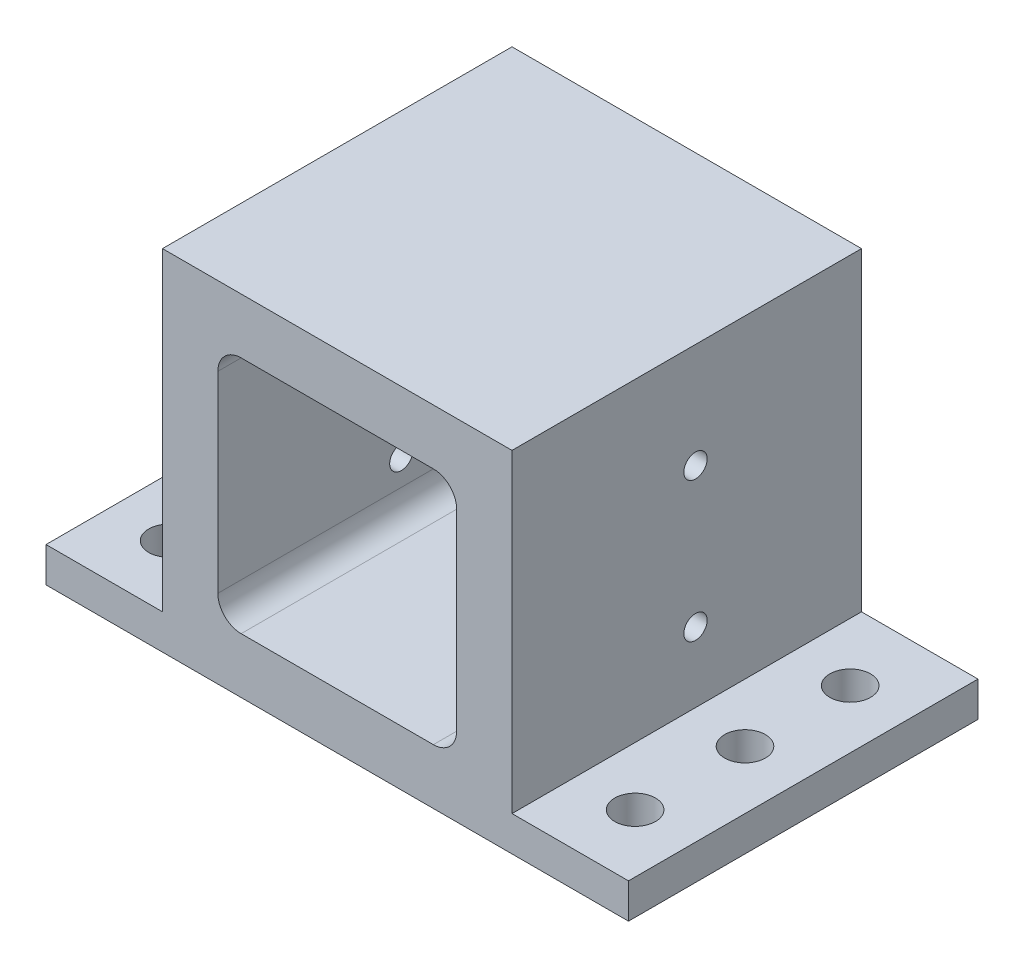
ISO-10303-21;
HEADER;
FILE_DESCRIPTION(('STEP AP214'),'2;1');
FILE_NAME('part.step','',(''),(''),'','','');
FILE_SCHEMA(('AUTOMOTIVE_DESIGN { 1 0 10303 214 1 1 1 1 }'));
ENDSEC;
DATA;
#1=APPLICATION_CONTEXT('core data for automotive mechanical design processes');
#2=APPLICATION_PROTOCOL_DEFINITION('international standard','automotive_design',2000,#1);
#3=PRODUCT_CONTEXT('',#1,'mechanical');
#4=PRODUCT('Part','Part','',(#3));
#5=PRODUCT_RELATED_PRODUCT_CATEGORY('part','',(#4));
#6=PRODUCT_DEFINITION_FORMATION('','',#4);
#7=PRODUCT_DEFINITION_CONTEXT('part definition',#1,'design');
#8=PRODUCT_DEFINITION('design','',#6,#7);
#9=PRODUCT_DEFINITION_SHAPE('','',#8);
#10=(LENGTH_UNIT() NAMED_UNIT(*) SI_UNIT(.MILLI.,.METRE.));
#11=(NAMED_UNIT(*) PLANE_ANGLE_UNIT() SI_UNIT($,.RADIAN.));
#12=(NAMED_UNIT(*) SI_UNIT($,.STERADIAN.) SOLID_ANGLE_UNIT());
#13=UNCERTAINTY_MEASURE_WITH_UNIT(LENGTH_MEASURE(1.E-05),#10,'distance_accuracy_value','');
#14=(GEOMETRIC_REPRESENTATION_CONTEXT(3) GLOBAL_UNCERTAINTY_ASSIGNED_CONTEXT((#13)) GLOBAL_UNIT_ASSIGNED_CONTEXT((#10,
#11,#12)) REPRESENTATION_CONTEXT('',''));
#15=CARTESIAN_POINT('',(0.,0.,0.));
#16=DIRECTION('',(0.,0.,1.));
#17=DIRECTION('',(1.,0.,0.));
#18=AXIS2_PLACEMENT_3D('',#15,#16,#17);
#19=CARTESIAN_POINT('',(0.,-54.,-60.));
#20=DIRECTION('',(1.,0.,0.));
#21=DIRECTION('',(0.,1.,0.));
#22=AXIS2_PLACEMENT_3D('',#19,#20,#21);
#23=PLANE('',#22);
#24=CARTESIAN_POINT('',(0.,-18.,-31.5004037887663));
#25=DIRECTION('',(1.,0.,0.));
#26=DIRECTION('',(0.,1.,0.));
#27=AXIS2_PLACEMENT_3D('',#24,#25,#26);
#28=CIRCLE('',#27,2.);
#29=CARTESIAN_POINT('',(0.,-16.,-31.5004037887663));
#30=VERTEX_POINT('',#29);
#31=EDGE_CURVE('E293',#30,#30,#28,.T.);
#32=ORIENTED_EDGE('',*,*,#31,.F.);
#33=EDGE_LOOP('',(#32));
#34=FACE_BOUND('',#33,.T.);
#35=CARTESIAN_POINT('',(0.,-42.,-31.5004037887663));
#36=DIRECTION('',(1.,0.,0.));
#37=DIRECTION('',(0.,1.,0.));
#38=AXIS2_PLACEMENT_3D('',#35,#36,#37);
#39=CIRCLE('',#38,2.);
#40=CARTESIAN_POINT('',(0.,-40.,-31.5004037887663));
#41=VERTEX_POINT('',#40);
#42=EDGE_CURVE('E274',#41,#41,#39,.T.);
#43=ORIENTED_EDGE('',*,*,#42,.F.);
#44=EDGE_LOOP('',(#43));
#45=FACE_BOUND('',#44,.T.);
#46=DIRECTION('',(0.,1.,0.));
#47=VECTOR('',#46,1.);
#48=CARTESIAN_POINT('',(0.,-54.,0.));
#49=LINE('',#48,#47);
#50=CARTESIAN_POINT('',(0.,-54.,0.));
#51=VERTEX_POINT('',#50);
#52=CARTESIAN_POINT('',(0.,0.,0.));
#53=VERTEX_POINT('',#52);
#54=EDGE_CURVE('E195',#51,#53,#49,.T.);
#55=ORIENTED_EDGE('',*,*,#54,.F.);
#56=DIRECTION('',(0.,0.,1.));
#57=VECTOR('',#56,1.);
#58=CARTESIAN_POINT('',(0.,-54.,-60.));
#59=LINE('',#58,#57);
#60=CARTESIAN_POINT('',(0.,-54.,-60.));
#61=VERTEX_POINT('',#60);
#62=EDGE_CURVE('E171',#61,#51,#59,.T.);
#63=ORIENTED_EDGE('',*,*,#62,.F.);
#64=DIRECTION('',(0.,1.,0.));
#65=VECTOR('',#64,1.);
#66=CARTESIAN_POINT('',(0.,-54.,-60.));
#67=LINE('',#66,#65);
#68=CARTESIAN_POINT('',(0.,0.,-60.));
#69=VERTEX_POINT('',#68);
#70=EDGE_CURVE('E165',#61,#69,#67,.T.);
#71=ORIENTED_EDGE('',*,*,#70,.T.);
#72=DIRECTION('',(0.,0.,1.));
#73=VECTOR('',#72,1.);
#74=CARTESIAN_POINT('',(0.,0.,-60.));
#75=LINE('',#74,#73);
#76=EDGE_CURVE('E147',#69,#53,#75,.T.);
#77=ORIENTED_EDGE('',*,*,#76,.T.);
#78=EDGE_LOOP('',(#55,#63,#71,#77));
#79=FACE_BOUND('',#78,.T.);
#80=ADVANCED_FACE('F33',(#34,#45,#79),#23,.T.);
#81=CARTESIAN_POINT('',(20.,-54.,-60.));
#82=DIRECTION('',(0.,1.,0.));
#83=DIRECTION('',(-1.,0.,0.));
#84=AXIS2_PLACEMENT_3D('',#81,#82,#83);
#85=PLANE('',#84);
#86=CARTESIAN_POINT('',(10.,-54.,-11.1342769223496));
#87=DIRECTION('',(0.,1.,0.));
#88=DIRECTION('',(-1.,0.,0.));
#89=AXIS2_PLACEMENT_3D('',#86,#87,#88);
#90=CIRCLE('',#89,3.50000000000001);
#91=CARTESIAN_POINT('',(6.50000000000001,-54.,-11.1342769223496));
#92=VERTEX_POINT('',#91);
#93=EDGE_CURVE('E318',#92,#92,#90,.T.);
#94=ORIENTED_EDGE('',*,*,#93,.F.);
#95=EDGE_LOOP('',(#94));
#96=FACE_BOUND('',#95,.T.);
#97=CARTESIAN_POINT('',(10.,-54.,-30.));
#98=DIRECTION('',(0.,1.,0.));
#99=DIRECTION('',(-1.,0.,0.));
#100=AXIS2_PLACEMENT_3D('',#97,#98,#99);
#101=CIRCLE('',#100,3.50000000000001);
#102=CARTESIAN_POINT('',(6.50000000000001,-54.,-30.));
#103=VERTEX_POINT('',#102);
#104=EDGE_CURVE('E315',#103,#103,#101,.T.);
#105=ORIENTED_EDGE('',*,*,#104,.F.);
#106=EDGE_LOOP('',(#105));
#107=FACE_BOUND('',#106,.T.);
#108=CARTESIAN_POINT('',(10.,-54.,-48.0521069880478));
#109=DIRECTION('',(0.,1.,0.));
#110=DIRECTION('',(-1.,0.,0.));
#111=AXIS2_PLACEMENT_3D('',#108,#109,#110);
#112=CIRCLE('',#111,3.50000000000001);
#113=CARTESIAN_POINT('',(6.50000000000001,-54.,-48.0521069880478));
#114=VERTEX_POINT('',#113);
#115=EDGE_CURVE('E266',#114,#114,#112,.T.);
#116=ORIENTED_EDGE('',*,*,#115,.F.);
#117=EDGE_LOOP('',(#116));
#118=FACE_BOUND('',#117,.T.);
#119=DIRECTION('',(-1.,0.,0.));
#120=VECTOR('',#119,1.);
#121=CARTESIAN_POINT('',(20.,-54.,0.));
#122=LINE('',#121,#120);
#123=CARTESIAN_POINT('',(20.,-54.,0.));
#124=VERTEX_POINT('',#123);
#125=EDGE_CURVE('E172',#124,#51,#122,.T.);
#126=ORIENTED_EDGE('',*,*,#125,.F.);
#127=DIRECTION('',(0.,0.,1.));
#128=VECTOR('',#127,1.);
#129=CARTESIAN_POINT('',(20.,-54.,-60.));
#130=LINE('',#129,#128);
#131=CARTESIAN_POINT('',(20.,-54.,-60.));
#132=VERTEX_POINT('',#131);
#133=EDGE_CURVE('E215',#132,#124,#130,.T.);
#134=ORIENTED_EDGE('',*,*,#133,.F.);
#135=DIRECTION('',(-1.,0.,0.));
#136=VECTOR('',#135,1.);
#137=CARTESIAN_POINT('',(20.,-54.,-60.));
#138=LINE('',#137,#136);
#139=EDGE_CURVE('E158',#132,#61,#138,.T.);
#140=ORIENTED_EDGE('',*,*,#139,.T.);
#141=ORIENTED_EDGE('',*,*,#62,.T.);
#142=EDGE_LOOP('',(#126,#134,#140,#141));
#143=FACE_BOUND('',#142,.T.);
#144=ADVANCED_FACE('F378',(#96,#107,#118,#143),#85,.T.);
#145=CARTESIAN_POINT('',(20.,-60.,-60.));
#146=DIRECTION('',(1.,0.,0.));
#147=DIRECTION('',(0.,0.,-1.));
#148=AXIS2_PLACEMENT_3D('',#145,#146,#147);
#149=PLANE('',#148);
#150=DIRECTION('',(0.,1.,0.));
#151=VECTOR('',#150,1.);
#152=CARTESIAN_POINT('',(20.,-60.,0.));
#153=LINE('',#152,#151);
#154=CARTESIAN_POINT('',(20.,-60.,0.));
#155=VERTEX_POINT('',#154);
#156=EDGE_CURVE('E175',#155,#124,#153,.T.);
#157=ORIENTED_EDGE('',*,*,#156,.F.);
#158=DIRECTION('',(0.,0.,1.));
#159=VECTOR('',#158,1.);
#160=CARTESIAN_POINT('',(20.,-60.,-60.));
#161=LINE('',#160,#159);
#162=CARTESIAN_POINT('',(20.,-60.,-60.));
#163=VERTEX_POINT('',#162);
#164=EDGE_CURVE('E217',#163,#155,#161,.T.);
#165=ORIENTED_EDGE('',*,*,#164,.F.);
#166=DIRECTION('',(0.,1.,0.));
#167=VECTOR('',#166,1.);
#168=CARTESIAN_POINT('',(20.,-60.,-60.));
#169=LINE('',#168,#167);
#170=EDGE_CURVE('E191',#163,#132,#169,.T.);
#171=ORIENTED_EDGE('',*,*,#170,.T.);
#172=ORIENTED_EDGE('',*,*,#133,.T.);
#173=EDGE_LOOP('',(#157,#165,#171,#172));
#174=FACE_BOUND('',#173,.T.);
#175=ADVANCED_FACE('F412',(#174),#149,.T.);
#176=CARTESIAN_POINT('',(-80.,-60.,-60.));
#177=DIRECTION('',(0.,-1.,0.));
#178=DIRECTION('',(1.,0.,0.));
#179=AXIS2_PLACEMENT_3D('',#176,#177,#178);
#180=PLANE('',#179);
#181=CARTESIAN_POINT('',(10.,-60.,-11.1342769223496));
#182=DIRECTION('',(0.,-1.,0.));
#183=DIRECTION('',(-1.,0.,0.));
#184=AXIS2_PLACEMENT_3D('',#181,#182,#183);
#185=CIRCLE('',#184,3.50000000000001);
#186=CARTESIAN_POINT('',(6.50000000000001,-60.,-11.1342769223496));
#187=VERTEX_POINT('',#186);
#188=EDGE_CURVE('E296',#187,#187,#185,.T.);
#189=ORIENTED_EDGE('',*,*,#188,.F.);
#190=EDGE_LOOP('',(#189));
#191=FACE_BOUND('',#190,.T.);
#192=CARTESIAN_POINT('',(10.,-60.,-30.));
#193=DIRECTION('',(0.,-1.,0.));
#194=DIRECTION('',(-1.,0.,0.));
#195=AXIS2_PLACEMENT_3D('',#192,#193,#194);
#196=CIRCLE('',#195,3.50000000000001);
#197=CARTESIAN_POINT('',(6.50000000000001,-60.,-30.));
#198=VERTEX_POINT('',#197);
#199=EDGE_CURVE('E306',#198,#198,#196,.T.);
#200=ORIENTED_EDGE('',*,*,#199,.F.);
#201=EDGE_LOOP('',(#200));
#202=FACE_BOUND('',#201,.T.);
#203=CARTESIAN_POINT('',(10.,-60.,-48.0521069880478));
#204=DIRECTION('',(0.,-1.,0.));
#205=DIRECTION('',(-1.,0.,0.));
#206=AXIS2_PLACEMENT_3D('',#203,#204,#205);
#207=CIRCLE('',#206,3.50000000000001);
#208=CARTESIAN_POINT('',(6.50000000000001,-60.,-48.0521069880478));
#209=VERTEX_POINT('',#208);
#210=EDGE_CURVE('E303',#209,#209,#207,.T.);
#211=ORIENTED_EDGE('',*,*,#210,.F.);
#212=EDGE_LOOP('',(#211));
#213=FACE_BOUND('',#212,.T.);
#214=CARTESIAN_POINT('',(-70.,-60.,-48.0521069880478));
#215=DIRECTION('',(0.,-1.,0.));
#216=DIRECTION('',(1.,0.,0.));
#217=AXIS2_PLACEMENT_3D('',#214,#215,#216);
#218=CIRCLE('',#217,3.50000000000001);
#219=CARTESIAN_POINT('',(-66.5,-60.,-48.0521069880478));
#220=VERTEX_POINT('',#219);
#221=EDGE_CURVE('E300',#220,#220,#218,.T.);
#222=ORIENTED_EDGE('',*,*,#221,.F.);
#223=EDGE_LOOP('',(#222));
#224=FACE_BOUND('',#223,.T.);
#225=CARTESIAN_POINT('',(-70.,-60.,-30.));
#226=DIRECTION('',(0.,-1.,0.));
#227=DIRECTION('',(1.,0.,0.));
#228=AXIS2_PLACEMENT_3D('',#225,#226,#227);
#229=CIRCLE('',#228,3.50000000000001);
#230=CARTESIAN_POINT('',(-66.5,-60.,-30.));
#231=VERTEX_POINT('',#230);
#232=EDGE_CURVE('E297',#231,#231,#229,.T.);
#233=ORIENTED_EDGE('',*,*,#232,.F.);
#234=EDGE_LOOP('',(#233));
#235=FACE_BOUND('',#234,.T.);
#236=CARTESIAN_POINT('',(-70.,-60.,-11.1342769223496));
#237=DIRECTION('',(0.,-1.,0.));
#238=DIRECTION('',(1.,0.,0.));
#239=AXIS2_PLACEMENT_3D('',#236,#237,#238);
#240=CIRCLE('',#239,3.50000000000001);
#241=CARTESIAN_POINT('',(-66.5,-60.,-11.1342769223496));
#242=VERTEX_POINT('',#241);
#243=EDGE_CURVE('E261',#242,#242,#240,.T.);
#244=ORIENTED_EDGE('',*,*,#243,.F.);
#245=EDGE_LOOP('',(#244));
#246=FACE_BOUND('',#245,.T.);
#247=DIRECTION('',(1.,0.,0.));
#248=VECTOR('',#247,1.);
#249=CARTESIAN_POINT('',(-80.,-60.,0.));
#250=LINE('',#249,#248);
#251=CARTESIAN_POINT('',(-80.,-60.,0.));
#252=VERTEX_POINT('',#251);
#253=EDGE_CURVE('E208',#252,#155,#250,.T.);
#254=ORIENTED_EDGE('',*,*,#253,.F.);
#255=DIRECTION('',(0.,0.,1.));
#256=VECTOR('',#255,1.);
#257=CARTESIAN_POINT('',(-80.,-60.,-60.));
#258=LINE('',#257,#256);
#259=CARTESIAN_POINT('',(-80.,-60.,-60.));
#260=VERTEX_POINT('',#259);
#261=EDGE_CURVE('E219',#260,#252,#258,.T.);
#262=ORIENTED_EDGE('',*,*,#261,.F.);
#263=DIRECTION('',(1.,0.,0.));
#264=VECTOR('',#263,1.);
#265=CARTESIAN_POINT('',(-80.,-60.,-60.));
#266=LINE('',#265,#264);
#267=EDGE_CURVE('E188',#260,#163,#266,.T.);
#268=ORIENTED_EDGE('',*,*,#267,.T.);
#269=ORIENTED_EDGE('',*,*,#164,.T.);
#270=EDGE_LOOP('',(#254,#262,#268,#269));
#271=FACE_BOUND('',#270,.T.);
#272=ADVANCED_FACE('F385',(#191,#202,#213,#224,#235,#246,#271),#180,.T.);
#273=CARTESIAN_POINT('',(-80.,-54.,-60.));
#274=DIRECTION('',(-1.,0.,0.));
#275=DIRECTION('',(0.,0.,1.));
#276=AXIS2_PLACEMENT_3D('',#273,#274,#275);
#277=PLANE('',#276);
#278=DIRECTION('',(0.,-1.,0.));
#279=VECTOR('',#278,1.);
#280=CARTESIAN_POINT('',(-80.,-54.,0.));
#281=LINE('',#280,#279);
#282=CARTESIAN_POINT('',(-80.,-54.,0.));
#283=VERTEX_POINT('',#282);
#284=EDGE_CURVE('E205',#283,#252,#281,.T.);
#285=ORIENTED_EDGE('',*,*,#284,.F.);
#286=DIRECTION('',(0.,0.,1.));
#287=VECTOR('',#286,1.);
#288=CARTESIAN_POINT('',(-80.,-54.,-60.));
#289=LINE('',#288,#287);
#290=CARTESIAN_POINT('',(-80.,-54.,-60.));
#291=VERTEX_POINT('',#290);
#292=EDGE_CURVE('E221',#291,#283,#289,.T.);
#293=ORIENTED_EDGE('',*,*,#292,.F.);
#294=DIRECTION('',(0.,-1.,0.));
#295=VECTOR('',#294,1.);
#296=CARTESIAN_POINT('',(-80.,-54.,-60.));
#297=LINE('',#296,#295);
#298=EDGE_CURVE('E185',#291,#260,#297,.T.);
#299=ORIENTED_EDGE('',*,*,#298,.T.);
#300=ORIENTED_EDGE('',*,*,#261,.T.);
#301=EDGE_LOOP('',(#285,#293,#299,#300));
#302=FACE_BOUND('',#301,.T.);
#303=ADVANCED_FACE('F388',(#302),#277,.T.);
#304=CARTESIAN_POINT('',(-60.,-54.,-60.));
#305=DIRECTION('',(0.,1.,0.));
#306=DIRECTION('',(-1.,0.,0.));
#307=AXIS2_PLACEMENT_3D('',#304,#305,#306);
#308=PLANE('',#307);
#309=CARTESIAN_POINT('',(-70.,-54.,-48.0521069880478));
#310=DIRECTION('',(0.,1.,0.));
#311=DIRECTION('',(-1.,0.,0.));
#312=AXIS2_PLACEMENT_3D('',#309,#310,#311);
#313=CIRCLE('',#312,3.50000000000001);
#314=CARTESIAN_POINT('',(-73.5,-54.,-48.0521069880478));
#315=VERTEX_POINT('',#314);
#316=EDGE_CURVE('E264',#315,#315,#313,.T.);
#317=ORIENTED_EDGE('',*,*,#316,.F.);
#318=EDGE_LOOP('',(#317));
#319=FACE_BOUND('',#318,.T.);
#320=CARTESIAN_POINT('',(-70.,-54.,-30.));
#321=DIRECTION('',(0.,1.,0.));
#322=DIRECTION('',(-1.,0.,0.));
#323=AXIS2_PLACEMENT_3D('',#320,#321,#322);
#324=CIRCLE('',#323,3.50000000000001);
#325=CARTESIAN_POINT('',(-73.5,-54.,-30.));
#326=VERTEX_POINT('',#325);
#327=EDGE_CURVE('E260',#326,#326,#324,.T.);
#328=ORIENTED_EDGE('',*,*,#327,.F.);
#329=EDGE_LOOP('',(#328));
#330=FACE_BOUND('',#329,.T.);
#331=CARTESIAN_POINT('',(-70.,-54.,-11.1342769223496));
#332=DIRECTION('',(0.,1.,0.));
#333=DIRECTION('',(-1.,0.,0.));
#334=AXIS2_PLACEMENT_3D('',#331,#332,#333);
#335=CIRCLE('',#334,3.50000000000001);
#336=CARTESIAN_POINT('',(-73.5,-54.,-11.1342769223496));
#337=VERTEX_POINT('',#336);
#338=EDGE_CURVE('E257',#337,#337,#335,.T.);
#339=ORIENTED_EDGE('',*,*,#338,.F.);
#340=EDGE_LOOP('',(#339));
#341=FACE_BOUND('',#340,.T.);
#342=DIRECTION('',(-1.,0.,0.));
#343=VECTOR('',#342,1.);
#344=CARTESIAN_POINT('',(-60.,-54.,0.));
#345=LINE('',#344,#343);
#346=CARTESIAN_POINT('',(-60.,-54.,0.));
#347=VERTEX_POINT('',#346);
#348=EDGE_CURVE('E202',#347,#283,#345,.T.);
#349=ORIENTED_EDGE('',*,*,#348,.F.);
#350=DIRECTION('',(0.,0.,1.));
#351=VECTOR('',#350,1.);
#352=CARTESIAN_POINT('',(-60.,-54.,-60.));
#353=LINE('',#352,#351);
#354=CARTESIAN_POINT('',(-60.,-54.,-60.));
#355=VERTEX_POINT('',#354);
#356=EDGE_CURVE('E223',#355,#347,#353,.T.);
#357=ORIENTED_EDGE('',*,*,#356,.F.);
#358=DIRECTION('',(-1.,0.,0.));
#359=VECTOR('',#358,1.);
#360=CARTESIAN_POINT('',(-60.,-54.,-60.));
#361=LINE('',#360,#359);
#362=EDGE_CURVE('E182',#355,#291,#361,.T.);
#363=ORIENTED_EDGE('',*,*,#362,.T.);
#364=ORIENTED_EDGE('',*,*,#292,.T.);
#365=EDGE_LOOP('',(#349,#357,#363,#364));
#366=FACE_BOUND('',#365,.T.);
#367=ADVANCED_FACE('F391',(#319,#330,#341,#366),#308,.T.);
#368=CARTESIAN_POINT('',(-60.,0.,-60.));
#369=DIRECTION('',(-1.,0.,0.));
#370=DIRECTION('',(0.,-1.,0.));
#371=AXIS2_PLACEMENT_3D('',#368,#369,#370);
#372=PLANE('',#371);
#373=CARTESIAN_POINT('',(-60.,-18.,-31.5004037887663));
#374=DIRECTION('',(-1.,0.,0.));
#375=DIRECTION('',(0.,-1.,0.));
#376=AXIS2_PLACEMENT_3D('',#373,#374,#375);
#377=CIRCLE('',#376,2.);
#378=CARTESIAN_POINT('',(-60.,-20.,-31.5004037887663));
#379=VERTEX_POINT('',#378);
#380=EDGE_CURVE('E270',#379,#379,#377,.T.);
#381=ORIENTED_EDGE('',*,*,#380,.F.);
#382=EDGE_LOOP('',(#381));
#383=FACE_BOUND('',#382,.T.);
#384=CARTESIAN_POINT('',(-60.,-42.,-31.5004037887663));
#385=DIRECTION('',(-1.,0.,0.));
#386=DIRECTION('',(0.,-1.,0.));
#387=AXIS2_PLACEMENT_3D('',#384,#385,#386);
#388=CIRCLE('',#387,2.);
#389=CARTESIAN_POINT('',(-60.,-44.,-31.5004037887663));
#390=VERTEX_POINT('',#389);
#391=EDGE_CURVE('E277',#390,#390,#388,.T.);
#392=ORIENTED_EDGE('',*,*,#391,.F.);
#393=EDGE_LOOP('',(#392));
#394=FACE_BOUND('',#393,.T.);
#395=DIRECTION('',(0.,-1.,0.));
#396=VECTOR('',#395,1.);
#397=CARTESIAN_POINT('',(-60.,0.,0.));
#398=LINE('',#397,#396);
#399=CARTESIAN_POINT('',(-60.,0.,0.));
#400=VERTEX_POINT('',#399);
#401=EDGE_CURVE('E199',#400,#347,#398,.T.);
#402=ORIENTED_EDGE('',*,*,#401,.F.);
#403=DIRECTION('',(0.,0.,1.));
#404=VECTOR('',#403,1.);
#405=CARTESIAN_POINT('',(-60.,0.,-60.));
#406=LINE('',#405,#404);
#407=CARTESIAN_POINT('',(-60.,0.,-60.));
#408=VERTEX_POINT('',#407);
#409=EDGE_CURVE('E157',#408,#400,#406,.T.);
#410=ORIENTED_EDGE('',*,*,#409,.F.);
#411=DIRECTION('',(0.,-1.,0.));
#412=VECTOR('',#411,1.);
#413=CARTESIAN_POINT('',(-60.,0.,-60.));
#414=LINE('',#413,#412);
#415=EDGE_CURVE('E169',#408,#355,#414,.T.);
#416=ORIENTED_EDGE('',*,*,#415,.T.);
#417=ORIENTED_EDGE('',*,*,#356,.T.);
#418=EDGE_LOOP('',(#402,#410,#416,#417));
#419=FACE_BOUND('',#418,.T.);
#420=ADVANCED_FACE('F394',(#383,#394,#419),#372,.T.);
#421=CARTESIAN_POINT('',(0.,0.,-60.));
#422=DIRECTION('',(0.,1.,0.));
#423=DIRECTION('',(-1.,0.,0.));
#424=AXIS2_PLACEMENT_3D('',#421,#422,#423);
#425=PLANE('',#424);
#426=DIRECTION('',(-1.,0.,0.));
#427=VECTOR('',#426,1.);
#428=CARTESIAN_POINT('',(0.,0.,0.));
#429=LINE('',#428,#427);
#430=EDGE_CURVE('E152',#53,#400,#429,.T.);
#431=ORIENTED_EDGE('',*,*,#430,.F.);
#432=ORIENTED_EDGE('',*,*,#76,.F.);
#433=DIRECTION('',(-1.,0.,0.));
#434=VECTOR('',#433,1.);
#435=CARTESIAN_POINT('',(0.,0.,-60.));
#436=LINE('',#435,#434);
#437=EDGE_CURVE('E150',#69,#408,#436,.T.);
#438=ORIENTED_EDGE('',*,*,#437,.T.);
#439=ORIENTED_EDGE('',*,*,#409,.T.);
#440=EDGE_LOOP('',(#431,#432,#438,#439));
#441=FACE_BOUND('',#440,.T.);
#442=ADVANCED_FACE('F149',(#441),#425,.T.);
#443=CARTESIAN_POINT('',(0.,0.,-60.));
#444=DIRECTION('',(0.,0.,1.));
#445=DIRECTION('',(1.,0.,0.));
#446=AXIS2_PLACEMENT_3D('',#443,#444,#445);
#447=PLANE('',#446);
#448=CARTESIAN_POINT('',(-30.,-17.5,-60.));
#449=DIRECTION('',(0.,0.,1.));
#450=DIRECTION('',(1.,0.,0.));
#451=AXIS2_PLACEMENT_3D('',#448,#449,#450);
#452=CIRCLE('',#451,1.35);
#453=CARTESIAN_POINT('',(-28.65,-17.5,-60.));
#454=VERTEX_POINT('',#453);
#455=EDGE_CURVE('E282',#454,#454,#452,.T.);
#456=ORIENTED_EDGE('',*,*,#455,.T.);
#457=EDGE_LOOP('',(#456));
#458=FACE_BOUND('',#457,.T.);
#459=ORIENTED_EDGE('',*,*,#70,.F.);
#460=ORIENTED_EDGE('',*,*,#139,.F.);
#461=ORIENTED_EDGE('',*,*,#170,.F.);
#462=ORIENTED_EDGE('',*,*,#267,.F.);
#463=ORIENTED_EDGE('',*,*,#298,.F.);
#464=ORIENTED_EDGE('',*,*,#362,.F.);
#465=ORIENTED_EDGE('',*,*,#415,.F.);
#466=ORIENTED_EDGE('',*,*,#437,.F.);
#467=EDGE_LOOP('',(#459,#460,#461,#462,#463,#464,#465,#466));
#468=FACE_BOUND('',#467,.T.);
#469=ADVANCED_FACE('F163',(#458,#468),#447,.F.);
#470=CARTESIAN_POINT('',(0.,0.,0.));
#471=DIRECTION('',(0.,0.,1.));
#472=DIRECTION('',(1.,0.,0.));
#473=AXIS2_PLACEMENT_3D('',#470,#471,#472);
#474=PLANE('',#473);
#475=DIRECTION('',(0.,-1.,0.));
#476=VECTOR('',#475,1.);
#477=CARTESIAN_POINT('',(-50.5,-9.5,0.));
#478=LINE('',#477,#476);
#479=CARTESIAN_POINT('',(-50.5,-13.5,0.));
#480=VERTEX_POINT('',#479);
#481=CARTESIAN_POINT('',(-50.5,-46.5,0.));
#482=VERTEX_POINT('',#481);
#483=EDGE_CURVE('E321',#480,#482,#478,.T.);
#484=ORIENTED_EDGE('',*,*,#483,.F.);
#485=CARTESIAN_POINT('',(-46.5,-13.5,0.));
#486=DIRECTION('',(0.,0.,1.));
#487=DIRECTION('',(1.,0.,0.));
#488=AXIS2_PLACEMENT_3D('',#485,#486,#487);
#489=CIRCLE('',#488,4.);
#490=CARTESIAN_POINT('',(-46.5,-9.5,0.));
#491=VERTEX_POINT('',#490);
#492=EDGE_CURVE('E11',#480,#491,#489,.F.);
#493=ORIENTED_EDGE('',*,*,#492,.T.);
#494=DIRECTION('',(-1.,0.,0.));
#495=VECTOR('',#494,1.);
#496=CARTESIAN_POINT('',(-50.5,-9.5,0.));
#497=LINE('',#496,#495);
#498=CARTESIAN_POINT('',(-13.5,-9.5,0.));
#499=VERTEX_POINT('',#498);
#500=EDGE_CURVE('E178',#499,#491,#497,.T.);
#501=ORIENTED_EDGE('',*,*,#500,.F.);
#502=CARTESIAN_POINT('',(-13.5,-13.5,0.));
#503=DIRECTION('',(0.,0.,1.));
#504=DIRECTION('',(1.,0.,0.));
#505=AXIS2_PLACEMENT_3D('',#502,#503,#504);
#506=CIRCLE('',#505,4.);
#507=CARTESIAN_POINT('',(-9.49999999999999,-13.5,0.));
#508=VERTEX_POINT('',#507);
#509=EDGE_CURVE('E252',#499,#508,#506,.F.);
#510=ORIENTED_EDGE('',*,*,#509,.T.);
#511=DIRECTION('',(0.,1.,0.));
#512=VECTOR('',#511,1.);
#513=CARTESIAN_POINT('',(-9.49999999999999,-9.5,0.));
#514=LINE('',#513,#512);
#515=CARTESIAN_POINT('',(-9.49999999999999,-46.5,0.));
#516=VERTEX_POINT('',#515);
#517=EDGE_CURVE('E336',#516,#508,#514,.T.);
#518=ORIENTED_EDGE('',*,*,#517,.F.);
#519=CARTESIAN_POINT('',(-13.5,-46.5,0.));
#520=DIRECTION('',(0.,0.,1.));
#521=DIRECTION('',(1.,0.,0.));
#522=AXIS2_PLACEMENT_3D('',#519,#520,#521);
#523=CIRCLE('',#522,4.);
#524=CARTESIAN_POINT('',(-13.5,-50.5,0.));
#525=VERTEX_POINT('',#524);
#526=EDGE_CURVE('E254',#516,#525,#523,.F.);
#527=ORIENTED_EDGE('',*,*,#526,.T.);
#528=DIRECTION('',(1.,0.,0.));
#529=VECTOR('',#528,1.);
#530=CARTESIAN_POINT('',(-50.5,-50.5,0.));
#531=LINE('',#530,#529);
#532=CARTESIAN_POINT('',(-46.5,-50.5,0.));
#533=VERTEX_POINT('',#532);
#534=EDGE_CURVE('E334',#533,#525,#531,.T.);
#535=ORIENTED_EDGE('',*,*,#534,.F.);
#536=CARTESIAN_POINT('',(-46.5,-46.5,0.));
#537=DIRECTION('',(0.,0.,1.));
#538=DIRECTION('',(1.,0.,0.));
#539=AXIS2_PLACEMENT_3D('',#536,#537,#538);
#540=CIRCLE('',#539,4.);
#541=EDGE_CURVE('E42',#533,#482,#540,.F.);
#542=ORIENTED_EDGE('',*,*,#541,.T.);
#543=EDGE_LOOP('',(#484,#493,#501,#510,#518,#527,#535,#542));
#544=FACE_BOUND('',#543,.T.);
#545=ORIENTED_EDGE('',*,*,#54,.T.);
#546=ORIENTED_EDGE('',*,*,#430,.T.);
#547=ORIENTED_EDGE('',*,*,#401,.T.);
#548=ORIENTED_EDGE('',*,*,#348,.T.);
#549=ORIENTED_EDGE('',*,*,#284,.T.);
#550=ORIENTED_EDGE('',*,*,#253,.T.);
#551=ORIENTED_EDGE('',*,*,#156,.T.);
#552=ORIENTED_EDGE('',*,*,#125,.T.);
#553=EDGE_LOOP('',(#545,#546,#547,#548,#549,#550,#551,#552));
#554=FACE_BOUND('',#553,.T.);
#555=ADVANCED_FACE('F371',(#544,#554),#474,.T.);
#556=CARTESIAN_POINT('',(-50.5,-9.5,-50.));
#557=DIRECTION('',(-1.,0.,0.));
#558=DIRECTION('',(0.,-1.,0.));
#559=AXIS2_PLACEMENT_3D('',#556,#557,#558);
#560=PLANE('',#559);
#561=CARTESIAN_POINT('',(-50.5,-18.,-31.5004037887663));
#562=DIRECTION('',(-1.,0.,0.));
#563=DIRECTION('',(0.,-1.,0.));
#564=AXIS2_PLACEMENT_3D('',#561,#562,#563);
#565=CIRCLE('',#564,2.);
#566=CARTESIAN_POINT('',(-50.5,-20.,-31.5004037887663));
#567=VERTEX_POINT('',#566);
#568=EDGE_CURVE('E290',#567,#567,#565,.T.);
#569=ORIENTED_EDGE('',*,*,#568,.T.);
#570=EDGE_LOOP('',(#569));
#571=FACE_BOUND('',#570,.T.);
#572=CARTESIAN_POINT('',(-50.5,-42.,-31.5004037887663));
#573=DIRECTION('',(-1.,0.,0.));
#574=DIRECTION('',(0.,-1.,0.));
#575=AXIS2_PLACEMENT_3D('',#572,#573,#574);
#576=CIRCLE('',#575,2.);
#577=CARTESIAN_POINT('',(-50.5,-44.,-31.5004037887663));
#578=VERTEX_POINT('',#577);
#579=EDGE_CURVE('E269',#578,#578,#576,.T.);
#580=ORIENTED_EDGE('',*,*,#579,.T.);
#581=EDGE_LOOP('',(#580));
#582=FACE_BOUND('',#581,.T.);
#583=ORIENTED_EDGE('',*,*,#483,.T.);
#584=DIRECTION('',(0.,0.,1.));
#585=VECTOR('',#584,1.);
#586=CARTESIAN_POINT('',(-50.5,-46.5,-50.));
#587=LINE('',#586,#585);
#588=CARTESIAN_POINT('',(-50.5,-46.5,-50.));
#589=VERTEX_POINT('',#588);
#590=EDGE_CURVE('E250',#482,#589,#587,.F.);
#591=ORIENTED_EDGE('',*,*,#590,.T.);
#592=DIRECTION('',(0.,-1.,0.));
#593=VECTOR('',#592,1.);
#594=CARTESIAN_POINT('',(-50.5,-9.5,-50.));
#595=LINE('',#594,#593);
#596=CARTESIAN_POINT('',(-50.5,-13.5,-50.));
#597=VERTEX_POINT('',#596);
#598=EDGE_CURVE('E322',#597,#589,#595,.T.);
#599=ORIENTED_EDGE('',*,*,#598,.F.);
#600=DIRECTION('',(0.,0.,1.));
#601=VECTOR('',#600,1.);
#602=CARTESIAN_POINT('',(-50.5,-13.5,0.));
#603=LINE('',#602,#601);
#604=EDGE_CURVE('E248',#597,#480,#603,.T.);
#605=ORIENTED_EDGE('',*,*,#604,.T.);
#606=EDGE_LOOP('',(#583,#591,#599,#605));
#607=FACE_BOUND('',#606,.T.);
#608=ADVANCED_FACE('F353',(#571,#582,#607),#560,.F.);
#609=CARTESIAN_POINT('',(-50.5,-9.5,-50.));
#610=DIRECTION('',(0.,1.,0.));
#611=DIRECTION('',(0.,0.,1.));
#612=AXIS2_PLACEMENT_3D('',#609,#610,#611);
#613=PLANE('',#612);
#614=DIRECTION('',(-1.,0.,0.));
#615=VECTOR('',#614,1.);
#616=CARTESIAN_POINT('',(-50.5,-9.5,-50.));
#617=LINE('',#616,#615);
#618=CARTESIAN_POINT('',(-13.5,-9.5,-50.));
#619=VERTEX_POINT('',#618);
#620=CARTESIAN_POINT('',(-46.5,-9.5,-50.));
#621=VERTEX_POINT('',#620);
#622=EDGE_CURVE('E197',#619,#621,#617,.T.);
#623=ORIENTED_EDGE('',*,*,#622,.F.);
#624=DIRECTION('',(0.,0.,1.));
#625=VECTOR('',#624,1.);
#626=CARTESIAN_POINT('',(-13.5,-9.5,0.));
#627=LINE('',#626,#625);
#628=EDGE_CURVE('E227',#619,#499,#627,.T.);
#629=ORIENTED_EDGE('',*,*,#628,.T.);
#630=ORIENTED_EDGE('',*,*,#500,.T.);
#631=DIRECTION('',(0.,0.,1.));
#632=VECTOR('',#631,1.);
#633=CARTESIAN_POINT('',(-46.5,-9.5,-50.));
#634=LINE('',#633,#632);
#635=EDGE_CURVE('E214',#491,#621,#634,.F.);
#636=ORIENTED_EDGE('',*,*,#635,.T.);
#637=EDGE_LOOP('',(#623,#629,#630,#636));
#638=FACE_BOUND('',#637,.T.);
#639=ADVANCED_FACE('F345',(#638),#613,.F.);
#640=CARTESIAN_POINT('',(-9.49999999999999,-9.5,-50.));
#641=DIRECTION('',(1.,0.,0.));
#642=DIRECTION('',(0.,1.,0.));
#643=AXIS2_PLACEMENT_3D('',#640,#641,#642);
#644=PLANE('',#643);
#645=CARTESIAN_POINT('',(-9.49999999999999,-18.,-31.5004037887663));
#646=DIRECTION('',(1.,0.,0.));
#647=DIRECTION('',(0.,1.,0.));
#648=AXIS2_PLACEMENT_3D('',#645,#646,#647);
#649=CIRCLE('',#648,2.);
#650=CARTESIAN_POINT('',(-9.49999999999999,-16.,-31.5004037887663));
#651=VERTEX_POINT('',#650);
#652=EDGE_CURVE('E37',#651,#651,#649,.T.);
#653=ORIENTED_EDGE('',*,*,#652,.T.);
#654=EDGE_LOOP('',(#653));
#655=FACE_BOUND('',#654,.T.);
#656=CARTESIAN_POINT('',(-9.49999999999999,-42.,-31.5004037887663));
#657=DIRECTION('',(1.,0.,0.));
#658=DIRECTION('',(0.,1.,0.));
#659=AXIS2_PLACEMENT_3D('',#656,#657,#658);
#660=CIRCLE('',#659,2.);
#661=CARTESIAN_POINT('',(-9.49999999999999,-40.,-31.5004037887663));
#662=VERTEX_POINT('',#661);
#663=EDGE_CURVE('E267',#662,#662,#660,.T.);
#664=ORIENTED_EDGE('',*,*,#663,.T.);
#665=EDGE_LOOP('',(#664));
#666=FACE_BOUND('',#665,.T.);
#667=ORIENTED_EDGE('',*,*,#517,.T.);
#668=DIRECTION('',(0.,0.,1.));
#669=VECTOR('',#668,1.);
#670=CARTESIAN_POINT('',(-9.49999999999999,-13.5,-50.));
#671=LINE('',#670,#669);
#672=CARTESIAN_POINT('',(-9.49999999999999,-13.5,-50.));
#673=VERTEX_POINT('',#672);
#674=EDGE_CURVE('E233',#508,#673,#671,.F.);
#675=ORIENTED_EDGE('',*,*,#674,.T.);
#676=DIRECTION('',(0.,1.,0.));
#677=VECTOR('',#676,1.);
#678=CARTESIAN_POINT('',(-9.49999999999999,-9.5,-50.));
#679=LINE('',#678,#677);
#680=CARTESIAN_POINT('',(-9.49999999999999,-46.5,-50.));
#681=VERTEX_POINT('',#680);
#682=EDGE_CURVE('E328',#681,#673,#679,.T.);
#683=ORIENTED_EDGE('',*,*,#682,.F.);
#684=DIRECTION('',(0.,0.,1.));
#685=VECTOR('',#684,1.);
#686=CARTESIAN_POINT('',(-9.49999999999999,-46.5,0.));
#687=LINE('',#686,#685);
#688=EDGE_CURVE('E230',#681,#516,#687,.T.);
#689=ORIENTED_EDGE('',*,*,#688,.T.);
#690=EDGE_LOOP('',(#667,#675,#683,#689));
#691=FACE_BOUND('',#690,.T.);
#692=ADVANCED_FACE('F368',(#655,#666,#691),#644,.F.);
#693=CARTESIAN_POINT('',(-50.5,-50.5,-50.));
#694=DIRECTION('',(0.,-1.,0.));
#695=DIRECTION('',(0.,0.,-1.));
#696=AXIS2_PLACEMENT_3D('',#693,#694,#695);
#697=PLANE('',#696);
#698=ORIENTED_EDGE('',*,*,#534,.T.);
#699=DIRECTION('',(0.,0.,1.));
#700=VECTOR('',#699,1.);
#701=CARTESIAN_POINT('',(-13.5,-50.5,-50.));
#702=LINE('',#701,#700);
#703=CARTESIAN_POINT('',(-13.5,-50.5,-50.));
#704=VERTEX_POINT('',#703);
#705=EDGE_CURVE('E246',#525,#704,#702,.F.);
#706=ORIENTED_EDGE('',*,*,#705,.T.);
#707=DIRECTION('',(1.,0.,0.));
#708=VECTOR('',#707,1.);
#709=CARTESIAN_POINT('',(-50.5,-50.5,-50.));
#710=LINE('',#709,#708);
#711=CARTESIAN_POINT('',(-46.5,-50.5,-50.));
#712=VERTEX_POINT('',#711);
#713=EDGE_CURVE('E325',#712,#704,#710,.T.);
#714=ORIENTED_EDGE('',*,*,#713,.F.);
#715=DIRECTION('',(0.,0.,1.));
#716=VECTOR('',#715,1.);
#717=CARTESIAN_POINT('',(-46.5,-50.5,0.));
#718=LINE('',#717,#716);
#719=EDGE_CURVE('E243',#712,#533,#718,.T.);
#720=ORIENTED_EDGE('',*,*,#719,.T.);
#721=EDGE_LOOP('',(#698,#706,#714,#720));
#722=FACE_BOUND('',#721,.T.);
#723=ADVANCED_FACE('F361',(#722),#697,.F.);
#724=CARTESIAN_POINT('',(0.,0.,-50.));
#725=DIRECTION('',(0.,0.,1.));
#726=DIRECTION('',(1.,0.,0.));
#727=AXIS2_PLACEMENT_3D('',#724,#725,#726);
#728=PLANE('',#727);
#729=CARTESIAN_POINT('',(-30.,-17.5,-50.));
#730=DIRECTION('',(0.,0.,1.));
#731=DIRECTION('',(1.,0.,0.));
#732=AXIS2_PLACEMENT_3D('',#729,#730,#731);
#733=CIRCLE('',#732,1.35);
#734=CARTESIAN_POINT('',(-28.65,-17.5,-50.));
#735=VERTEX_POINT('',#734);
#736=EDGE_CURVE('E285',#735,#735,#733,.T.);
#737=ORIENTED_EDGE('',*,*,#736,.F.);
#738=EDGE_LOOP('',(#737));
#739=FACE_BOUND('',#738,.T.);
#740=ORIENTED_EDGE('',*,*,#682,.T.);
#741=CARTESIAN_POINT('',(-13.5,-13.5,-50.));
#742=DIRECTION('',(0.,0.,1.));
#743=DIRECTION('',(1.,0.,0.));
#744=AXIS2_PLACEMENT_3D('',#741,#742,#743);
#745=CIRCLE('',#744,4.);
#746=EDGE_CURVE('E241',#673,#619,#745,.T.);
#747=ORIENTED_EDGE('',*,*,#746,.T.);
#748=ORIENTED_EDGE('',*,*,#622,.T.);
#749=CARTESIAN_POINT('',(-46.5,-13.5,-50.));
#750=DIRECTION('',(0.,0.,1.));
#751=DIRECTION('',(1.,0.,0.));
#752=AXIS2_PLACEMENT_3D('',#749,#750,#751);
#753=CIRCLE('',#752,4.);
#754=EDGE_CURVE('E235',#621,#597,#753,.T.);
#755=ORIENTED_EDGE('',*,*,#754,.T.);
#756=ORIENTED_EDGE('',*,*,#598,.T.);
#757=CARTESIAN_POINT('',(-46.5,-46.5,-50.));
#758=DIRECTION('',(0.,0.,1.));
#759=DIRECTION('',(1.,0.,0.));
#760=AXIS2_PLACEMENT_3D('',#757,#758,#759);
#761=CIRCLE('',#760,4.);
#762=EDGE_CURVE('E237',#589,#712,#761,.T.);
#763=ORIENTED_EDGE('',*,*,#762,.T.);
#764=ORIENTED_EDGE('',*,*,#713,.T.);
#765=CARTESIAN_POINT('',(-13.5,-46.5,-50.));
#766=DIRECTION('',(0.,0.,1.));
#767=DIRECTION('',(1.,0.,0.));
#768=AXIS2_PLACEMENT_3D('',#765,#766,#767);
#769=CIRCLE('',#768,4.);
#770=EDGE_CURVE('E239',#704,#681,#769,.T.);
#771=ORIENTED_EDGE('',*,*,#770,.T.);
#772=EDGE_LOOP('',(#740,#747,#748,#755,#756,#763,#764,#771));
#773=FACE_BOUND('',#772,.T.);
#774=ADVANCED_FACE('F350',(#739,#773),#728,.T.);
#775=CARTESIAN_POINT('',(-13.5,-13.5,-50.));
#776=DIRECTION('',(0.,0.,-1.));
#777=DIRECTION('',(-1.,0.,0.));
#778=AXIS2_PLACEMENT_3D('',#775,#776,#777);
#779=CYLINDRICAL_SURFACE('',#778,4.);
#780=ORIENTED_EDGE('',*,*,#746,.F.);
#781=ORIENTED_EDGE('',*,*,#674,.F.);
#782=ORIENTED_EDGE('',*,*,#509,.F.);
#783=ORIENTED_EDGE('',*,*,#628,.F.);
#784=EDGE_LOOP('',(#780,#781,#782,#783));
#785=FACE_BOUND('',#784,.T.);
#786=ADVANCED_FACE('F370',(#785),#779,.F.);
#787=CARTESIAN_POINT('',(-13.5,-46.5,-50.));
#788=DIRECTION('',(0.,0.,-1.));
#789=DIRECTION('',(-1.,0.,0.));
#790=AXIS2_PLACEMENT_3D('',#787,#788,#789);
#791=CYLINDRICAL_SURFACE('',#790,4.);
#792=ORIENTED_EDGE('',*,*,#770,.F.);
#793=ORIENTED_EDGE('',*,*,#705,.F.);
#794=ORIENTED_EDGE('',*,*,#526,.F.);
#795=ORIENTED_EDGE('',*,*,#688,.F.);
#796=EDGE_LOOP('',(#792,#793,#794,#795));
#797=FACE_BOUND('',#796,.T.);
#798=ADVANCED_FACE('F364',(#797),#791,.F.);
#799=CARTESIAN_POINT('',(-46.5,-46.5,-50.));
#800=DIRECTION('',(0.,0.,-1.));
#801=DIRECTION('',(-1.,0.,0.));
#802=AXIS2_PLACEMENT_3D('',#799,#800,#801);
#803=CYLINDRICAL_SURFACE('',#802,4.);
#804=ORIENTED_EDGE('',*,*,#762,.F.);
#805=ORIENTED_EDGE('',*,*,#590,.F.);
#806=ORIENTED_EDGE('',*,*,#541,.F.);
#807=ORIENTED_EDGE('',*,*,#719,.F.);
#808=EDGE_LOOP('',(#804,#805,#806,#807));
#809=FACE_BOUND('',#808,.T.);
#810=ADVANCED_FACE('F356',(#809),#803,.F.);
#811=CARTESIAN_POINT('',(-46.5,-13.5,-50.));
#812=DIRECTION('',(0.,0.,-1.));
#813=DIRECTION('',(-1.,0.,0.));
#814=AXIS2_PLACEMENT_3D('',#811,#812,#813);
#815=CYLINDRICAL_SURFACE('',#814,4.);
#816=ORIENTED_EDGE('',*,*,#754,.F.);
#817=ORIENTED_EDGE('',*,*,#635,.F.);
#818=ORIENTED_EDGE('',*,*,#492,.F.);
#819=ORIENTED_EDGE('',*,*,#604,.F.);
#820=EDGE_LOOP('',(#816,#817,#818,#819));
#821=FACE_BOUND('',#820,.T.);
#822=ADVANCED_FACE('F35',(#821),#815,.F.);
#823=CARTESIAN_POINT('',(-70.,0.,-11.1342769223496));
#824=DIRECTION('',(0.,-1.,0.));
#825=DIRECTION('',(1.,0.,0.));
#826=AXIS2_PLACEMENT_3D('',#823,#824,#825);
#827=CYLINDRICAL_SURFACE('',#826,3.50000000000001);
#828=ORIENTED_EDGE('',*,*,#338,.T.);
#829=EDGE_LOOP('',(#828));
#830=FACE_BOUND('',#829,.T.);
#831=ORIENTED_EDGE('',*,*,#243,.T.);
#832=EDGE_LOOP('',(#831));
#833=FACE_BOUND('',#832,.T.);
#834=ADVANCED_FACE('F425',(#830,#833),#827,.F.);
#835=CARTESIAN_POINT('',(-70.,0.,-30.));
#836=DIRECTION('',(0.,-1.,0.));
#837=DIRECTION('',(1.,0.,0.));
#838=AXIS2_PLACEMENT_3D('',#835,#836,#837);
#839=CYLINDRICAL_SURFACE('',#838,3.50000000000001);
#840=ORIENTED_EDGE('',*,*,#327,.T.);
#841=EDGE_LOOP('',(#840));
#842=FACE_BOUND('',#841,.T.);
#843=ORIENTED_EDGE('',*,*,#232,.T.);
#844=EDGE_LOOP('',(#843));
#845=FACE_BOUND('',#844,.T.);
#846=ADVANCED_FACE('F429',(#842,#845),#839,.F.);
#847=CARTESIAN_POINT('',(-70.,0.,-48.0521069880478));
#848=DIRECTION('',(0.,-1.,0.));
#849=DIRECTION('',(1.,0.,0.));
#850=AXIS2_PLACEMENT_3D('',#847,#848,#849);
#851=CYLINDRICAL_SURFACE('',#850,3.50000000000001);
#852=ORIENTED_EDGE('',*,*,#316,.T.);
#853=EDGE_LOOP('',(#852));
#854=FACE_BOUND('',#853,.T.);
#855=ORIENTED_EDGE('',*,*,#221,.T.);
#856=EDGE_LOOP('',(#855));
#857=FACE_BOUND('',#856,.T.);
#858=ADVANCED_FACE('F435',(#854,#857),#851,.F.);
#859=CARTESIAN_POINT('',(10.,0.,-48.0521069880478));
#860=DIRECTION('',(0.,-1.,0.));
#861=DIRECTION('',(1.,0.,0.));
#862=AXIS2_PLACEMENT_3D('',#859,#860,#861);
#863=CYLINDRICAL_SURFACE('',#862,3.50000000000001);
#864=ORIENTED_EDGE('',*,*,#115,.T.);
#865=EDGE_LOOP('',(#864));
#866=FACE_BOUND('',#865,.T.);
#867=ORIENTED_EDGE('',*,*,#210,.T.);
#868=EDGE_LOOP('',(#867));
#869=FACE_BOUND('',#868,.T.);
#870=ADVANCED_FACE('F499',(#866,#869),#863,.F.);
#871=CARTESIAN_POINT('',(10.,0.,-30.));
#872=DIRECTION('',(0.,-1.,0.));
#873=DIRECTION('',(1.,0.,0.));
#874=AXIS2_PLACEMENT_3D('',#871,#872,#873);
#875=CYLINDRICAL_SURFACE('',#874,3.50000000000001);
#876=ORIENTED_EDGE('',*,*,#104,.T.);
#877=EDGE_LOOP('',(#876));
#878=FACE_BOUND('',#877,.T.);
#879=ORIENTED_EDGE('',*,*,#199,.T.);
#880=EDGE_LOOP('',(#879));
#881=FACE_BOUND('',#880,.T.);
#882=ADVANCED_FACE('F509',(#878,#881),#875,.F.);
#883=CARTESIAN_POINT('',(10.,0.,-11.1342769223496));
#884=DIRECTION('',(0.,-1.,0.));
#885=DIRECTION('',(1.,0.,0.));
#886=AXIS2_PLACEMENT_3D('',#883,#884,#885);
#887=CYLINDRICAL_SURFACE('',#886,3.50000000000001);
#888=ORIENTED_EDGE('',*,*,#93,.T.);
#889=EDGE_LOOP('',(#888));
#890=FACE_BOUND('',#889,.T.);
#891=ORIENTED_EDGE('',*,*,#188,.T.);
#892=EDGE_LOOP('',(#891));
#893=FACE_BOUND('',#892,.T.);
#894=ADVANCED_FACE('F441',(#890,#893),#887,.F.);
#895=CARTESIAN_POINT('',(20.,-42.,-31.5004037887663));
#896=DIRECTION('',(-1.,0.,0.));
#897=DIRECTION('',(0.,-1.,0.));
#898=AXIS2_PLACEMENT_3D('',#895,#896,#897);
#899=CYLINDRICAL_SURFACE('',#898,2.);
#900=ORIENTED_EDGE('',*,*,#42,.T.);
#901=EDGE_LOOP('',(#900));
#902=FACE_BOUND('',#901,.T.);
#903=ORIENTED_EDGE('',*,*,#663,.F.);
#904=EDGE_LOOP('',(#903));
#905=FACE_BOUND('',#904,.T.);
#906=ADVANCED_FACE('F526',(#902,#905),#899,.F.);
#907=CARTESIAN_POINT('',(20.,-18.,-31.5004037887663));
#908=DIRECTION('',(-1.,0.,0.));
#909=DIRECTION('',(0.,-1.,0.));
#910=AXIS2_PLACEMENT_3D('',#907,#908,#909);
#911=CYLINDRICAL_SURFACE('',#910,2.);
#912=ORIENTED_EDGE('',*,*,#31,.T.);
#913=EDGE_LOOP('',(#912));
#914=FACE_BOUND('',#913,.T.);
#915=ORIENTED_EDGE('',*,*,#652,.F.);
#916=EDGE_LOOP('',(#915));
#917=FACE_BOUND('',#916,.T.);
#918=ADVANCED_FACE('F560',(#914,#917),#911,.F.);
#919=ORIENTED_EDGE('',*,*,#391,.T.);
#920=EDGE_LOOP('',(#919));
#921=FACE_BOUND('',#920,.T.);
#922=ORIENTED_EDGE('',*,*,#579,.F.);
#923=EDGE_LOOP('',(#922));
#924=FACE_BOUND('',#923,.T.);
#925=ADVANCED_FACE('F563',(#921,#924),#899,.F.);
#926=ORIENTED_EDGE('',*,*,#380,.T.);
#927=EDGE_LOOP('',(#926));
#928=FACE_BOUND('',#927,.T.);
#929=ORIENTED_EDGE('',*,*,#568,.F.);
#930=EDGE_LOOP('',(#929));
#931=FACE_BOUND('',#930,.T.);
#932=ADVANCED_FACE('F573',(#928,#931),#911,.F.);
#933=CARTESIAN_POINT('',(-30.,-17.5,-60.));
#934=DIRECTION('',(0.,0.,1.));
#935=DIRECTION('',(1.,0.,0.));
#936=AXIS2_PLACEMENT_3D('',#933,#934,#935);
#937=CYLINDRICAL_SURFACE('',#936,1.35);
#938=ORIENTED_EDGE('',*,*,#455,.F.);
#939=EDGE_LOOP('',(#938));
#940=FACE_BOUND('',#939,.T.);
#941=ORIENTED_EDGE('',*,*,#736,.T.);
#942=EDGE_LOOP('',(#941));
#943=FACE_BOUND('',#942,.T.);
#944=ADVANCED_FACE('F589',(#940,#943),#937,.F.);
#945=CLOSED_SHELL('',(#80,#144,#175,#272,#303,#367,#420,#442,#469,#555,#608,#639,#692,#723,#774,
#786,#798,#810,#822,#834,#846,#858,#870,#882,#894,#906,#918,#925,#932,#944));
#946=MANIFOLD_SOLID_BREP('B2',#945);
#947=ADVANCED_BREP_SHAPE_REPRESENTATION('',(#18,#946),#14);
#948=SHAPE_DEFINITION_REPRESENTATION(#9,#947);
ENDSEC;
END-ISO-10303-21;
